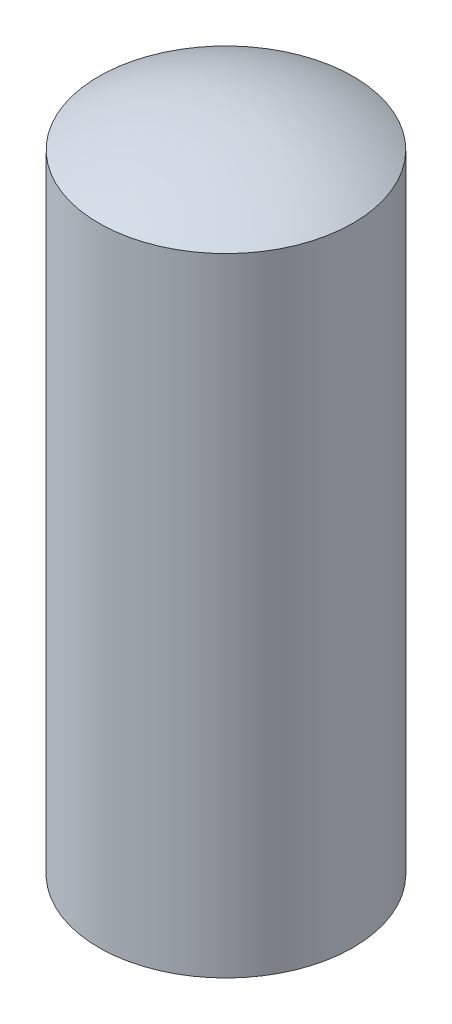
ISO-10303-21;
HEADER;
FILE_DESCRIPTION(('STEP AP214'),'2;1');
FILE_NAME('part.step','',(''),(''),'','','');
FILE_SCHEMA(('AUTOMOTIVE_DESIGN { 1 0 10303 214 1 1 1 1 }'));
ENDSEC;
DATA;
#1=APPLICATION_CONTEXT('core data for automotive mechanical design processes');
#2=APPLICATION_PROTOCOL_DEFINITION('international standard','automotive_design',2000,#1);
#3=PRODUCT_CONTEXT('',#1,'mechanical');
#4=PRODUCT('Part','Part','',(#3));
#5=PRODUCT_RELATED_PRODUCT_CATEGORY('part','',(#4));
#6=PRODUCT_DEFINITION_FORMATION('','',#4);
#7=PRODUCT_DEFINITION_CONTEXT('part definition',#1,'design');
#8=PRODUCT_DEFINITION('design','',#6,#7);
#9=PRODUCT_DEFINITION_SHAPE('','',#8);
#10=(LENGTH_UNIT() NAMED_UNIT(*) SI_UNIT(.MILLI.,.METRE.));
#11=(NAMED_UNIT(*) PLANE_ANGLE_UNIT() SI_UNIT($,.RADIAN.));
#12=(NAMED_UNIT(*) SI_UNIT($,.STERADIAN.) SOLID_ANGLE_UNIT());
#13=UNCERTAINTY_MEASURE_WITH_UNIT(LENGTH_MEASURE(1.E-05),#10,'distance_accuracy_value','');
#14=(GEOMETRIC_REPRESENTATION_CONTEXT(3) GLOBAL_UNCERTAINTY_ASSIGNED_CONTEXT((#13)) GLOBAL_UNIT_ASSIGNED_CONTEXT((#10,
#11,#12)) REPRESENTATION_CONTEXT('',''));
#15=CARTESIAN_POINT('',(0.,0.,0.));
#16=DIRECTION('',(0.,0.,1.));
#17=DIRECTION('',(1.,0.,0.));
#18=AXIS2_PLACEMENT_3D('',#15,#16,#17);
#19=CARTESIAN_POINT('',(0.750000000000001,0.,0.));
#20=DIRECTION('',(0.,-1.,0.));
#21=DIRECTION('',(1.,0.,0.));
#22=AXIS2_PLACEMENT_3D('',#19,#20,#21);
#23=PLANE('',#22);
#24=CARTESIAN_POINT('',(0.,0.,0.));
#25=DIRECTION('',(0.,-1.,0.));
#26=DIRECTION('',(1.,0.,0.));
#27=AXIS2_PLACEMENT_3D('',#24,#25,#26);
#28=CIRCLE('',#27,0.750000000000001);
#29=CARTESIAN_POINT('',(0.750000000000001,0.,0.));
#30=VERTEX_POINT('',#29);
#31=EDGE_CURVE('E48',#30,#30,#28,.T.);
#32=ORIENTED_EDGE('',*,*,#31,.T.);
#33=EDGE_LOOP('',(#32));
#34=FACE_BOUND('',#33,.T.);
#35=ADVANCED_FACE('F42',(#34),#23,.T.);
#36=CARTESIAN_POINT('',(0.,2.39375,0.));
#37=DIRECTION('',(0.,-1.,0.));
#38=DIRECTION('',(1.,0.,0.));
#39=AXIS2_PLACEMENT_3D('',#36,#37,#38);
#40=SPHERICAL_SURFACE('',#39,1.50625);
#41=CARTESIAN_POINT('',(0.,3.7,0.));
#42=DIRECTION('',(0.,-1.,0.));
#43=DIRECTION('',(1.,0.,0.));
#44=AXIS2_PLACEMENT_3D('',#41,#42,#43);
#45=CIRCLE('',#44,0.75);
#46=CARTESIAN_POINT('',(0.750000000000001,3.7,0.));
#47=VERTEX_POINT('',#46);
#48=EDGE_CURVE('E12',#47,#47,#45,.T.);
#49=ORIENTED_EDGE('',*,*,#48,.F.);
#50=EDGE_LOOP('',(#49));
#51=FACE_BOUND('',#50,.T.);
#52=ADVANCED_FACE('F57',(#51),#40,.T.);
#53=CARTESIAN_POINT('',(0.,0.,0.));
#54=DIRECTION('',(0.,-1.,0.));
#55=DIRECTION('',(1.,0.,0.));
#56=AXIS2_PLACEMENT_3D('',#53,#54,#55);
#57=CYLINDRICAL_SURFACE('',#56,0.75);
#58=ORIENTED_EDGE('',*,*,#48,.T.);
#59=EDGE_LOOP('',(#58));
#60=FACE_BOUND('',#59,.T.);
#61=ORIENTED_EDGE('',*,*,#31,.F.);
#62=EDGE_LOOP('',(#61));
#63=FACE_BOUND('',#62,.T.);
#64=ADVANCED_FACE('F55',(#60,#63),#57,.T.);
#65=CLOSED_SHELL('',(#35,#52,#64));
#66=MANIFOLD_SOLID_BREP('B2',#65);
#67=ADVANCED_BREP_SHAPE_REPRESENTATION('',(#18,#66),#14);
#68=SHAPE_DEFINITION_REPRESENTATION(#9,#67);
ENDSEC;
END-ISO-10303-21;
